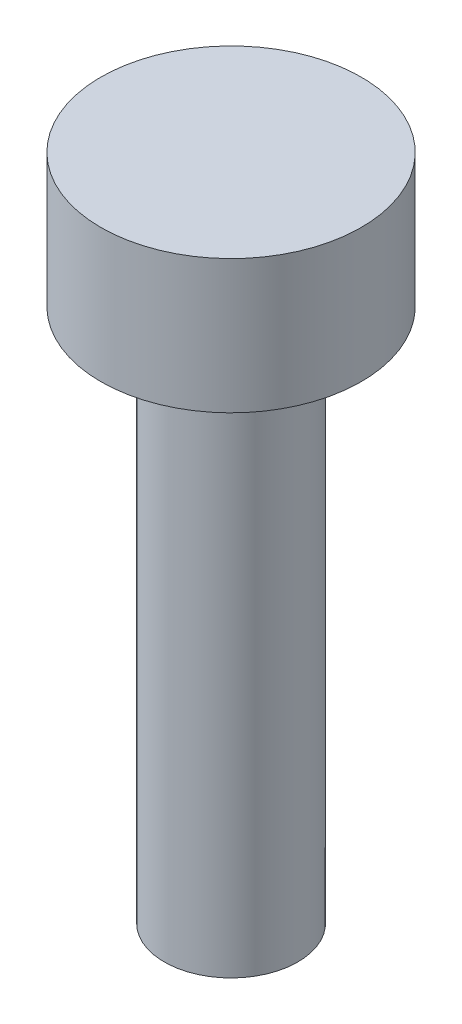
ISO-10303-21;
HEADER;
FILE_DESCRIPTION(('STEP AP214'),'2;1');
FILE_NAME('part.step','',(''),(''),'','','');
FILE_SCHEMA(('AUTOMOTIVE_DESIGN { 1 0 10303 214 1 1 1 1 }'));
ENDSEC;
DATA;
#1=APPLICATION_CONTEXT('core data for automotive mechanical design processes');
#2=APPLICATION_PROTOCOL_DEFINITION('international standard','automotive_design',2000,#1);
#3=PRODUCT_CONTEXT('',#1,'mechanical');
#4=PRODUCT('Part','Part','',(#3));
#5=PRODUCT_RELATED_PRODUCT_CATEGORY('part','',(#4));
#6=PRODUCT_DEFINITION_FORMATION('','',#4);
#7=PRODUCT_DEFINITION_CONTEXT('part definition',#1,'design');
#8=PRODUCT_DEFINITION('design','',#6,#7);
#9=PRODUCT_DEFINITION_SHAPE('','',#8);
#10=(LENGTH_UNIT() NAMED_UNIT(*) SI_UNIT(.MILLI.,.METRE.));
#11=(NAMED_UNIT(*) PLANE_ANGLE_UNIT() SI_UNIT($,.RADIAN.));
#12=(NAMED_UNIT(*) SI_UNIT($,.STERADIAN.) SOLID_ANGLE_UNIT());
#13=UNCERTAINTY_MEASURE_WITH_UNIT(LENGTH_MEASURE(1.E-05),#10,'distance_accuracy_value','');
#14=(GEOMETRIC_REPRESENTATION_CONTEXT(3) GLOBAL_UNCERTAINTY_ASSIGNED_CONTEXT((#13)) GLOBAL_UNIT_ASSIGNED_CONTEXT((#10,
#11,#12)) REPRESENTATION_CONTEXT('',''));
#15=CARTESIAN_POINT('',(0.,0.,0.));
#16=DIRECTION('',(0.,0.,1.));
#17=DIRECTION('',(1.,0.,0.));
#18=AXIS2_PLACEMENT_3D('',#15,#16,#17);
#19=CARTESIAN_POINT('',(0.,2.,0.));
#20=DIRECTION('',(0.,-1.,0.));
#21=DIRECTION('',(0.,0.,-1.));
#22=AXIS2_PLACEMENT_3D('',#19,#20,#21);
#23=CYLINDRICAL_SURFACE('',#22,1.95);
#24=CARTESIAN_POINT('',(0.,2.,0.));
#25=DIRECTION('',(0.,1.,0.));
#26=DIRECTION('',(0.,0.,1.));
#27=AXIS2_PLACEMENT_3D('',#24,#25,#26);
#28=CIRCLE('',#27,1.95);
#29=CARTESIAN_POINT('',(0.,2.,1.95));
#30=VERTEX_POINT('',#29);
#31=EDGE_CURVE('E49',#30,#30,#28,.T.);
#32=ORIENTED_EDGE('',*,*,#31,.F.);
#33=EDGE_LOOP('',(#32));
#34=FACE_BOUND('',#33,.T.);
#35=CARTESIAN_POINT('',(0.,0.,0.));
#36=DIRECTION('',(0.,1.,0.));
#37=DIRECTION('',(0.,0.,1.));
#38=AXIS2_PLACEMENT_3D('',#35,#36,#37);
#39=CIRCLE('',#38,1.95);
#40=CARTESIAN_POINT('',(0.,0.,1.95));
#41=VERTEX_POINT('',#40);
#42=EDGE_CURVE('E44',#41,#41,#39,.T.);
#43=ORIENTED_EDGE('',*,*,#42,.T.);
#44=EDGE_LOOP('',(#43));
#45=FACE_BOUND('',#44,.T.);
#46=ADVANCED_FACE('F41',(#34,#45),#23,.T.);
#47=CARTESIAN_POINT('',(0.,2.,0.));
#48=DIRECTION('',(0.,1.,0.));
#49=DIRECTION('',(0.,0.,1.));
#50=AXIS2_PLACEMENT_3D('',#47,#48,#49);
#51=PLANE('',#50);
#52=ORIENTED_EDGE('',*,*,#31,.T.);
#53=EDGE_LOOP('',(#52));
#54=FACE_BOUND('',#53,.T.);
#55=ADVANCED_FACE('F69',(#54),#51,.T.);
#56=CARTESIAN_POINT('',(0.,0.,0.));
#57=DIRECTION('',(0.,1.,0.));
#58=DIRECTION('',(0.,0.,1.));
#59=AXIS2_PLACEMENT_3D('',#56,#57,#58);
#60=PLANE('',#59);
#61=CARTESIAN_POINT('',(0.,0.,0.));
#62=DIRECTION('',(0.,-1.,0.));
#63=DIRECTION('',(0.,0.,-1.));
#64=AXIS2_PLACEMENT_3D('',#61,#62,#63);
#65=CIRCLE('',#64,1.);
#66=CARTESIAN_POINT('',(0.,0.,-1.));
#67=VERTEX_POINT('',#66);
#68=EDGE_CURVE('E10',#67,#67,#65,.T.);
#69=ORIENTED_EDGE('',*,*,#68,.F.);
#70=EDGE_LOOP('',(#69));
#71=FACE_BOUND('',#70,.T.);
#72=ORIENTED_EDGE('',*,*,#42,.F.);
#73=EDGE_LOOP('',(#72));
#74=FACE_BOUND('',#73,.T.);
#75=ADVANCED_FACE('F66',(#71,#74),#60,.F.);
#76=CARTESIAN_POINT('',(0.,-8.,0.));
#77=DIRECTION('',(0.,1.,0.));
#78=DIRECTION('',(0.,0.,1.));
#79=AXIS2_PLACEMENT_3D('',#76,#77,#78);
#80=CYLINDRICAL_SURFACE('',#79,1.);
#81=CARTESIAN_POINT('',(0.,-8.,0.));
#82=DIRECTION('',(0.,-1.,0.));
#83=DIRECTION('',(0.,0.,-1.));
#84=AXIS2_PLACEMENT_3D('',#81,#82,#83);
#85=CIRCLE('',#84,1.);
#86=CARTESIAN_POINT('',(0.,-8.,-1.));
#87=VERTEX_POINT('',#86);
#88=EDGE_CURVE('E56',#87,#87,#85,.T.);
#89=ORIENTED_EDGE('',*,*,#88,.F.);
#90=EDGE_LOOP('',(#89));
#91=FACE_BOUND('',#90,.T.);
#92=ORIENTED_EDGE('',*,*,#68,.T.);
#93=EDGE_LOOP('',(#92));
#94=FACE_BOUND('',#93,.T.);
#95=ADVANCED_FACE('F68',(#91,#94),#80,.T.);
#96=CARTESIAN_POINT('',(0.,-8.,0.));
#97=DIRECTION('',(0.,-1.,0.));
#98=DIRECTION('',(0.,0.,-1.));
#99=AXIS2_PLACEMENT_3D('',#96,#97,#98);
#100=PLANE('',#99);
#101=ORIENTED_EDGE('',*,*,#88,.T.);
#102=EDGE_LOOP('',(#101));
#103=FACE_BOUND('',#102,.T.);
#104=ADVANCED_FACE('F75',(#103),#100,.T.);
#105=CLOSED_SHELL('',(#46,#55,#75,#95,#104));
#106=MANIFOLD_SOLID_BREP('B2',#105);
#107=ADVANCED_BREP_SHAPE_REPRESENTATION('',(#18,#106),#14);
#108=SHAPE_DEFINITION_REPRESENTATION(#9,#107);
ENDSEC;
END-ISO-10303-21;
